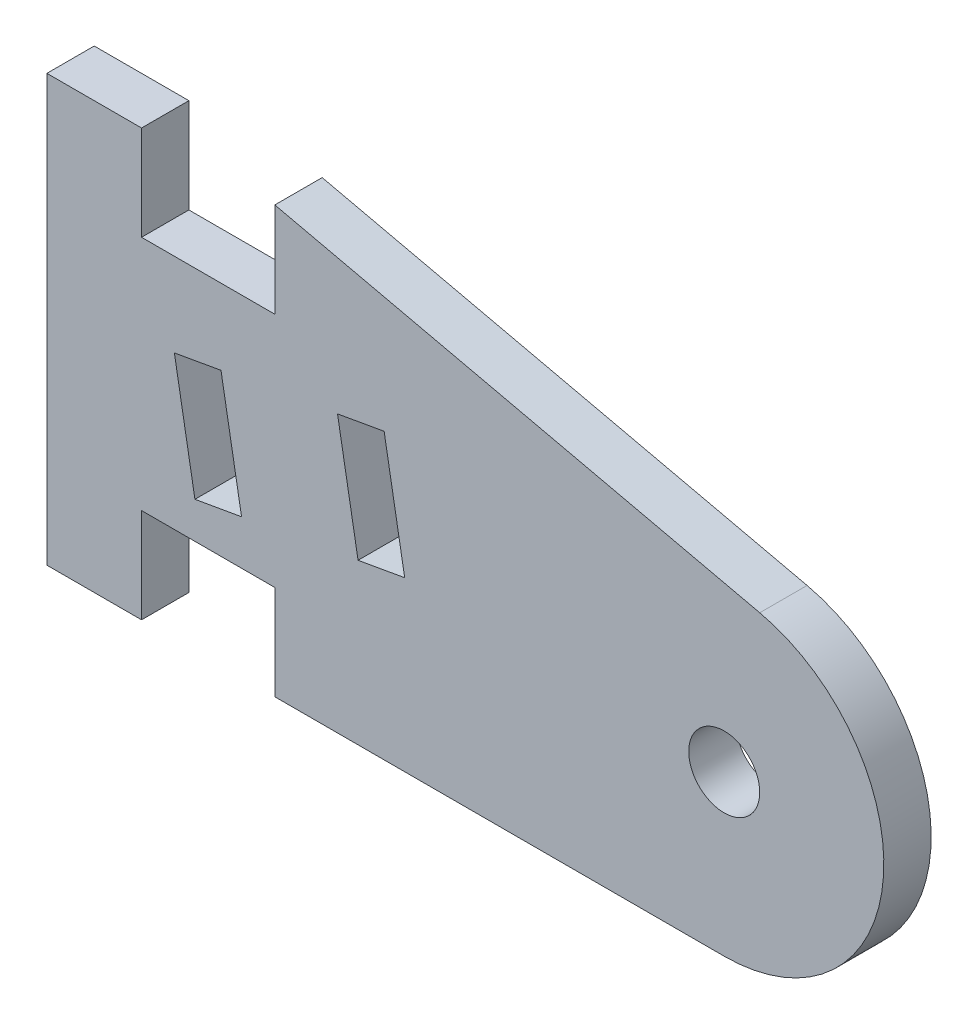
ISO-10303-21;
HEADER;
FILE_DESCRIPTION(('STEP AP214'),'2;1');
FILE_NAME('part.step','',(''),(''),'','','');
FILE_SCHEMA(('AUTOMOTIVE_DESIGN { 1 0 10303 214 1 1 1 1 }'));
ENDSEC;
DATA;
#1=APPLICATION_CONTEXT('core data for automotive mechanical design processes');
#2=APPLICATION_PROTOCOL_DEFINITION('international standard','automotive_design',2000,#1);
#3=PRODUCT_CONTEXT('',#1,'mechanical');
#4=PRODUCT('Part','Part','',(#3));
#5=PRODUCT_RELATED_PRODUCT_CATEGORY('part','',(#4));
#6=PRODUCT_DEFINITION_FORMATION('','',#4);
#7=PRODUCT_DEFINITION_CONTEXT('part definition',#1,'design');
#8=PRODUCT_DEFINITION('design','',#6,#7);
#9=PRODUCT_DEFINITION_SHAPE('','',#8);
#10=(LENGTH_UNIT() NAMED_UNIT(*) SI_UNIT(.MILLI.,.METRE.));
#11=(NAMED_UNIT(*) PLANE_ANGLE_UNIT() SI_UNIT($,.RADIAN.));
#12=(NAMED_UNIT(*) SI_UNIT($,.STERADIAN.) SOLID_ANGLE_UNIT());
#13=UNCERTAINTY_MEASURE_WITH_UNIT(LENGTH_MEASURE(1.E-05),#10,'distance_accuracy_value','');
#14=(GEOMETRIC_REPRESENTATION_CONTEXT(3) GLOBAL_UNCERTAINTY_ASSIGNED_CONTEXT((#13)) GLOBAL_UNIT_ASSIGNED_CONTEXT((#10,
#11,#12)) REPRESENTATION_CONTEXT('',''));
#15=CARTESIAN_POINT('',(0.,0.,0.));
#16=DIRECTION('',(0.,0.,1.));
#17=DIRECTION('',(1.,0.,0.));
#18=AXIS2_PLACEMENT_3D('',#15,#16,#17);
#19=CARTESIAN_POINT('',(28.6215163494173,6.74504414299814,2.));
#20=DIRECTION('',(0.,0.,1.));
#21=DIRECTION('',(1.,0.,0.));
#22=AXIS2_PLACEMENT_3D('',#19,#20,#21);
#23=PLANE('',#22);
#24=DIRECTION('',(-0.984807753012208,-0.173648177666932,0.));
#25=VECTOR('',#24,1.);
#26=CARTESIAN_POINT('',(14.2504500193325,12.02557168038,2.));
#27=LINE('',#26,#25);
#28=CARTESIAN_POINT('',(14.2504500193325,12.02557168038,2.));
#29=VERTEX_POINT('',#28);
#30=CARTESIAN_POINT('',(12.280834513308,11.6782753250461,2.));
#31=VERTEX_POINT('',#30);
#32=EDGE_CURVE('E178',#29,#31,#27,.T.);
#33=ORIENTED_EDGE('',*,*,#32,.F.);
#34=DIRECTION('',(-0.173648177666932,0.984807753012208,0.));
#35=VECTOR('',#34,1.);
#36=CARTESIAN_POINT('',(14.2504500193325,12.02557168038,2.));
#37=LINE('',#36,#35);
#38=CARTESIAN_POINT('',(15.1186909076671,7.10153291531894,2.));
#39=VERTEX_POINT('',#38);
#40=EDGE_CURVE('E170',#39,#29,#37,.T.);
#41=ORIENTED_EDGE('',*,*,#40,.F.);
#42=DIRECTION('',(0.984807753012208,0.173648177666931,0.));
#43=VECTOR('',#42,1.);
#44=CARTESIAN_POINT('',(13.1490754016427,6.75423655998508,2.));
#45=LINE('',#44,#43);
#46=CARTESIAN_POINT('',(13.1490754016427,6.75423655998508,2.));
#47=VERTEX_POINT('',#46);
#48=EDGE_CURVE('E193',#47,#39,#45,.T.);
#49=ORIENTED_EDGE('',*,*,#48,.F.);
#50=DIRECTION('',(0.173648177666932,-0.984807753012208,0.));
#51=VECTOR('',#50,1.);
#52=CARTESIAN_POINT('',(12.280834513308,11.6782753250461,2.));
#53=LINE('',#52,#51);
#54=EDGE_CURVE('E191',#31,#47,#53,.T.);
#55=ORIENTED_EDGE('',*,*,#54,.F.);
#56=EDGE_LOOP('',(#33,#41,#49,#55));
#57=FACE_BOUND('',#56,.T.);
#58=DIRECTION('',(0.,-1.,0.));
#59=VECTOR('',#58,1.);
#60=CARTESIAN_POINT('',(9.63151634941732,18.0003410835651,2.));
#61=LINE('',#60,#59);
#62=CARTESIAN_POINT('',(9.63151634941732,18.0003410835651,2.));
#63=VERTEX_POINT('',#62);
#64=CARTESIAN_POINT('',(9.63151634941733,14.0003410835651,2.));
#65=VERTEX_POINT('',#64);
#66=EDGE_CURVE('E240',#63,#65,#61,.T.);
#67=ORIENTED_EDGE('',*,*,#66,.T.);
#68=DIRECTION('',(-1.,0.,0.));
#69=VECTOR('',#68,1.);
#70=CARTESIAN_POINT('',(9.63151634941733,14.0003410835651,2.));
#71=LINE('',#70,#69);
#72=CARTESIAN_POINT('',(4.,14.0003410835651,2.));
#73=VERTEX_POINT('',#72);
#74=EDGE_CURVE('E243',#65,#73,#71,.T.);
#75=ORIENTED_EDGE('',*,*,#74,.T.);
#76=DIRECTION('',(0.,1.,0.));
#77=VECTOR('',#76,1.);
#78=CARTESIAN_POINT('',(4.,18.0003410835651,2.));
#79=LINE('',#78,#77);
#80=CARTESIAN_POINT('',(4.,18.0003410835651,2.));
#81=VERTEX_POINT('',#80);
#82=EDGE_CURVE('E246',#73,#81,#79,.T.);
#83=ORIENTED_EDGE('',*,*,#82,.T.);
#84=DIRECTION('',(-1.,0.,0.));
#85=VECTOR('',#84,1.);
#86=CARTESIAN_POINT('',(0.,18.0003410835651,2.));
#87=LINE('',#86,#85);
#88=CARTESIAN_POINT('',(0.,18.0003410835651,2.));
#89=VERTEX_POINT('',#88);
#90=EDGE_CURVE('E248',#81,#89,#87,.T.);
#91=ORIENTED_EDGE('',*,*,#90,.T.);
#92=DIRECTION('',(0.,-1.,0.));
#93=VECTOR('',#92,1.);
#94=CARTESIAN_POINT('',(0.,0.,2.));
#95=LINE('',#94,#93);
#96=CARTESIAN_POINT('',(0.,0.,2.));
#97=VERTEX_POINT('',#96);
#98=EDGE_CURVE('E250',#89,#97,#95,.T.);
#99=ORIENTED_EDGE('',*,*,#98,.T.);
#100=DIRECTION('',(1.,0.,0.));
#101=VECTOR('',#100,1.);
#102=CARTESIAN_POINT('',(0.,0.,2.));
#103=LINE('',#102,#101);
#104=CARTESIAN_POINT('',(4.,0.,2.));
#105=VERTEX_POINT('',#104);
#106=EDGE_CURVE('E252',#97,#105,#103,.T.);
#107=ORIENTED_EDGE('',*,*,#106,.T.);
#108=DIRECTION('',(0.,1.,0.));
#109=VECTOR('',#108,1.);
#110=CARTESIAN_POINT('',(4.,0.,2.));
#111=LINE('',#110,#109);
#112=CARTESIAN_POINT('',(4.,4.,2.));
#113=VERTEX_POINT('',#112);
#114=EDGE_CURVE('E254',#105,#113,#111,.T.);
#115=ORIENTED_EDGE('',*,*,#114,.T.);
#116=DIRECTION('',(1.,0.,0.));
#117=VECTOR('',#116,1.);
#118=CARTESIAN_POINT('',(9.63151634941733,4.,2.));
#119=LINE('',#118,#117);
#120=CARTESIAN_POINT('',(9.63151634941733,4.,2.));
#121=VERTEX_POINT('',#120);
#122=EDGE_CURVE('E256',#113,#121,#119,.T.);
#123=ORIENTED_EDGE('',*,*,#122,.T.);
#124=DIRECTION('',(0.,-1.,0.));
#125=VECTOR('',#124,1.);
#126=CARTESIAN_POINT('',(9.63151634941733,0.,2.));
#127=LINE('',#126,#125);
#128=CARTESIAN_POINT('',(9.63151634941733,0.,2.));
#129=VERTEX_POINT('',#128);
#130=EDGE_CURVE('E258',#121,#129,#127,.T.);
#131=ORIENTED_EDGE('',*,*,#130,.T.);
#132=DIRECTION('',(1.,0.,0.));
#133=VECTOR('',#132,1.);
#134=CARTESIAN_POINT('',(9.63151634941733,0.,2.));
#135=LINE('',#134,#133);
#136=CARTESIAN_POINT('',(28.6215163494173,0.,2.));
#137=VERTEX_POINT('',#136);
#138=EDGE_CURVE('E260',#129,#137,#135,.T.);
#139=ORIENTED_EDGE('',*,*,#138,.T.);
#140=CARTESIAN_POINT('',(28.6215163494173,6.74504414299814,2.));
#141=DIRECTION('',(0.,0.,1.));
#142=DIRECTION('',(1.,0.,0.));
#143=AXIS2_PLACEMENT_3D('',#140,#141,#142);
#144=CIRCLE('',#143,6.74504414299814);
#145=CARTESIAN_POINT('',(30.1231764912827,13.3208054912624,2.));
#146=VERTEX_POINT('',#145);
#147=EDGE_CURVE('E262',#137,#146,#144,.T.);
#148=ORIENTED_EDGE('',*,*,#147,.T.);
#149=DIRECTION('',(-0.974902640939778,0.222631625535649,0.));
#150=VECTOR('',#149,1.);
#151=CARTESIAN_POINT('',(9.63151634941732,18.0003410835651,2.));
#152=LINE('',#151,#150);
#153=EDGE_CURVE('E264',#146,#63,#152,.T.);
#154=ORIENTED_EDGE('',*,*,#153,.T.);
#155=EDGE_LOOP('',(#67,#75,#83,#91,#99,#107,#115,#123,#131,#139,#148,#154));
#156=FACE_BOUND('',#155,.T.);
#157=DIRECTION('',(0.173648177666931,-0.984807753012208,0.));
#158=VECTOR('',#157,1.);
#159=CARTESIAN_POINT('',(5.38718024222247,10.4627380813776,2.));
#160=LINE('',#159,#158);
#161=CARTESIAN_POINT('',(5.38718024222247,10.4627380813776,2.));
#162=VERTEX_POINT('',#161);
#163=CARTESIAN_POINT('',(6.25542113055713,5.53869931631654,2.));
#164=VERTEX_POINT('',#163);
#165=EDGE_CURVE('E211',#162,#164,#160,.T.);
#166=ORIENTED_EDGE('',*,*,#165,.F.);
#167=DIRECTION('',(-0.984807753012208,-0.173648177666931,0.));
#168=VECTOR('',#167,1.);
#169=CARTESIAN_POINT('',(7.35679574824689,10.8100344367115,2.));
#170=LINE('',#169,#168);
#171=CARTESIAN_POINT('',(7.35679574824689,10.8100344367115,2.));
#172=VERTEX_POINT('',#171);
#173=EDGE_CURVE('E209',#172,#162,#170,.T.);
#174=ORIENTED_EDGE('',*,*,#173,.F.);
#175=DIRECTION('',(-0.173648177666931,0.984807753012208,0.));
#176=VECTOR('',#175,1.);
#177=CARTESIAN_POINT('',(7.35679574824689,10.8100344367115,2.));
#178=LINE('',#177,#176);
#179=CARTESIAN_POINT('',(8.22503663658155,5.88599567165041,2.));
#180=VERTEX_POINT('',#179);
#181=EDGE_CURVE('E217',#180,#172,#178,.T.);
#182=ORIENTED_EDGE('',*,*,#181,.F.);
#183=DIRECTION('',(0.984807753012208,0.173648177666932,0.));
#184=VECTOR('',#183,1.);
#185=CARTESIAN_POINT('',(6.25542113055713,5.53869931631654,2.));
#186=LINE('',#185,#184);
#187=EDGE_CURVE('E214',#164,#180,#186,.T.);
#188=ORIENTED_EDGE('',*,*,#187,.F.);
#189=EDGE_LOOP('',(#166,#174,#182,#188));
#190=FACE_BOUND('',#189,.T.);
#191=CARTESIAN_POINT('',(28.6215163494173,6.74504414299814,2.));
#192=DIRECTION('',(0.,0.,1.));
#193=DIRECTION('',(1.,0.,0.));
#194=AXIS2_PLACEMENT_3D('',#191,#192,#193);
#195=CIRCLE('',#194,1.49999999999871);
#196=CARTESIAN_POINT('',(30.121516349416,6.74504414299814,2.));
#197=VERTEX_POINT('',#196);
#198=EDGE_CURVE('E199',#197,#197,#195,.T.);
#199=ORIENTED_EDGE('',*,*,#198,.F.);
#200=EDGE_LOOP('',(#199));
#201=FACE_BOUND('',#200,.T.);
#202=ADVANCED_FACE('F33',(#57,#156,#190,#201),#23,.T.);
#203=CARTESIAN_POINT('',(28.6215163494173,6.74504414299814,0.));
#204=DIRECTION('',(0.,0.,1.));
#205=DIRECTION('',(1.,0.,0.));
#206=AXIS2_PLACEMENT_3D('',#203,#204,#205);
#207=PLANE('',#206);
#208=DIRECTION('',(-0.173648177666932,0.984807753012208,0.));
#209=VECTOR('',#208,1.);
#210=CARTESIAN_POINT('',(14.2504500193325,12.02557168038,0.));
#211=LINE('',#210,#209);
#212=CARTESIAN_POINT('',(15.1186909076671,7.10153291531894,0.));
#213=VERTEX_POINT('',#212);
#214=CARTESIAN_POINT('',(14.2504500193325,12.02557168038,0.));
#215=VERTEX_POINT('',#214);
#216=EDGE_CURVE('E56',#213,#215,#211,.T.);
#217=ORIENTED_EDGE('',*,*,#216,.T.);
#218=DIRECTION('',(-0.984807753012208,-0.173648177666932,0.));
#219=VECTOR('',#218,1.);
#220=CARTESIAN_POINT('',(14.2504500193325,12.02557168038,0.));
#221=LINE('',#220,#219);
#222=CARTESIAN_POINT('',(12.280834513308,11.6782753250461,0.));
#223=VERTEX_POINT('',#222);
#224=EDGE_CURVE('E185',#215,#223,#221,.T.);
#225=ORIENTED_EDGE('',*,*,#224,.T.);
#226=DIRECTION('',(0.173648177666932,-0.984807753012208,0.));
#227=VECTOR('',#226,1.);
#228=CARTESIAN_POINT('',(12.280834513308,11.6782753250461,0.));
#229=LINE('',#228,#227);
#230=CARTESIAN_POINT('',(13.1490754016427,6.75423655998508,0.));
#231=VERTEX_POINT('',#230);
#232=EDGE_CURVE('E201',#223,#231,#229,.T.);
#233=ORIENTED_EDGE('',*,*,#232,.T.);
#234=DIRECTION('',(0.984807753012208,0.173648177666931,0.));
#235=VECTOR('',#234,1.);
#236=CARTESIAN_POINT('',(13.1490754016427,6.75423655998508,0.));
#237=LINE('',#236,#235);
#238=EDGE_CURVE('E179',#231,#213,#237,.T.);
#239=ORIENTED_EDGE('',*,*,#238,.T.);
#240=EDGE_LOOP('',(#217,#225,#233,#239));
#241=FACE_BOUND('',#240,.T.);
#242=DIRECTION('',(0.,-1.,0.));
#243=VECTOR('',#242,1.);
#244=CARTESIAN_POINT('',(9.63151634941732,18.0003410835651,0.));
#245=LINE('',#244,#243);
#246=CARTESIAN_POINT('',(9.63151634941732,18.0003410835651,0.));
#247=VERTEX_POINT('',#246);
#248=CARTESIAN_POINT('',(9.63151634941733,14.0003410835651,0.));
#249=VERTEX_POINT('',#248);
#250=EDGE_CURVE('E239',#247,#249,#245,.T.);
#251=ORIENTED_EDGE('',*,*,#250,.F.);
#252=DIRECTION('',(-0.974902640939778,0.222631625535649,0.));
#253=VECTOR('',#252,1.);
#254=CARTESIAN_POINT('',(9.63151634941732,18.0003410835651,0.));
#255=LINE('',#254,#253);
#256=CARTESIAN_POINT('',(30.1231764912827,13.3208054912624,0.));
#257=VERTEX_POINT('',#256);
#258=EDGE_CURVE('E244',#257,#247,#255,.T.);
#259=ORIENTED_EDGE('',*,*,#258,.F.);
#260=CARTESIAN_POINT('',(28.6215163494173,6.74504414299814,0.));
#261=DIRECTION('',(0.,0.,1.));
#262=DIRECTION('',(1.,0.,0.));
#263=AXIS2_PLACEMENT_3D('',#260,#261,#262);
#264=CIRCLE('',#263,6.74504414299814);
#265=CARTESIAN_POINT('',(28.6215163494173,0.,0.));
#266=VERTEX_POINT('',#265);
#267=EDGE_CURVE('E287',#266,#257,#264,.T.);
#268=ORIENTED_EDGE('',*,*,#267,.F.);
#269=DIRECTION('',(1.,0.,0.));
#270=VECTOR('',#269,1.);
#271=CARTESIAN_POINT('',(9.63151634941733,0.,0.));
#272=LINE('',#271,#270);
#273=CARTESIAN_POINT('',(9.63151634941733,0.,0.));
#274=VERTEX_POINT('',#273);
#275=EDGE_CURVE('E285',#274,#266,#272,.T.);
#276=ORIENTED_EDGE('',*,*,#275,.F.);
#277=DIRECTION('',(0.,-1.,0.));
#278=VECTOR('',#277,1.);
#279=CARTESIAN_POINT('',(9.63151634941733,0.,0.));
#280=LINE('',#279,#278);
#281=CARTESIAN_POINT('',(9.63151634941733,4.,0.));
#282=VERTEX_POINT('',#281);
#283=EDGE_CURVE('E283',#282,#274,#280,.T.);
#284=ORIENTED_EDGE('',*,*,#283,.F.);
#285=DIRECTION('',(1.,0.,0.));
#286=VECTOR('',#285,1.);
#287=CARTESIAN_POINT('',(9.63151634941733,4.,0.));
#288=LINE('',#287,#286);
#289=CARTESIAN_POINT('',(4.,4.,0.));
#290=VERTEX_POINT('',#289);
#291=EDGE_CURVE('E281',#290,#282,#288,.T.);
#292=ORIENTED_EDGE('',*,*,#291,.F.);
#293=DIRECTION('',(0.,1.,0.));
#294=VECTOR('',#293,1.);
#295=CARTESIAN_POINT('',(4.,0.,0.));
#296=LINE('',#295,#294);
#297=CARTESIAN_POINT('',(4.,0.,0.));
#298=VERTEX_POINT('',#297);
#299=EDGE_CURVE('E279',#298,#290,#296,.T.);
#300=ORIENTED_EDGE('',*,*,#299,.F.);
#301=DIRECTION('',(1.,0.,0.));
#302=VECTOR('',#301,1.);
#303=CARTESIAN_POINT('',(0.,0.,0.));
#304=LINE('',#303,#302);
#305=CARTESIAN_POINT('',(0.,0.,0.));
#306=VERTEX_POINT('',#305);
#307=EDGE_CURVE('E277',#306,#298,#304,.T.);
#308=ORIENTED_EDGE('',*,*,#307,.F.);
#309=DIRECTION('',(0.,-1.,0.));
#310=VECTOR('',#309,1.);
#311=CARTESIAN_POINT('',(0.,0.,0.));
#312=LINE('',#311,#310);
#313=CARTESIAN_POINT('',(0.,18.0003410835651,0.));
#314=VERTEX_POINT('',#313);
#315=EDGE_CURVE('E275',#314,#306,#312,.T.);
#316=ORIENTED_EDGE('',*,*,#315,.F.);
#317=DIRECTION('',(-1.,0.,0.));
#318=VECTOR('',#317,1.);
#319=CARTESIAN_POINT('',(0.,18.0003410835651,0.));
#320=LINE('',#319,#318);
#321=CARTESIAN_POINT('',(4.,18.0003410835651,0.));
#322=VERTEX_POINT('',#321);
#323=EDGE_CURVE('E273',#322,#314,#320,.T.);
#324=ORIENTED_EDGE('',*,*,#323,.F.);
#325=DIRECTION('',(0.,1.,0.));
#326=VECTOR('',#325,1.);
#327=CARTESIAN_POINT('',(4.,18.0003410835651,0.));
#328=LINE('',#327,#326);
#329=CARTESIAN_POINT('',(4.,14.0003410835651,0.));
#330=VERTEX_POINT('',#329);
#331=EDGE_CURVE('E271',#330,#322,#328,.T.);
#332=ORIENTED_EDGE('',*,*,#331,.F.);
#333=DIRECTION('',(-1.,0.,0.));
#334=VECTOR('',#333,1.);
#335=CARTESIAN_POINT('',(9.63151634941733,14.0003410835651,0.));
#336=LINE('',#335,#334);
#337=EDGE_CURVE('E269',#249,#330,#336,.T.);
#338=ORIENTED_EDGE('',*,*,#337,.F.);
#339=EDGE_LOOP('',(#251,#259,#268,#276,#284,#292,#300,#308,#316,#324,#332,#338));
#340=FACE_BOUND('',#339,.T.);
#341=DIRECTION('',(-0.984807753012208,-0.173648177666931,0.));
#342=VECTOR('',#341,1.);
#343=CARTESIAN_POINT('',(7.35679574824689,10.8100344367115,0.));
#344=LINE('',#343,#342);
#345=CARTESIAN_POINT('',(7.35679574824689,10.8100344367115,0.));
#346=VERTEX_POINT('',#345);
#347=CARTESIAN_POINT('',(5.38718024222247,10.4627380813776,0.));
#348=VERTEX_POINT('',#347);
#349=EDGE_CURVE('E186',#346,#348,#344,.T.);
#350=ORIENTED_EDGE('',*,*,#349,.T.);
#351=DIRECTION('',(0.173648177666931,-0.984807753012208,0.));
#352=VECTOR('',#351,1.);
#353=CARTESIAN_POINT('',(5.38718024222247,10.4627380813776,0.));
#354=LINE('',#353,#352);
#355=CARTESIAN_POINT('',(6.25542113055713,5.53869931631654,0.));
#356=VERTEX_POINT('',#355);
#357=EDGE_CURVE('E222',#348,#356,#354,.T.);
#358=ORIENTED_EDGE('',*,*,#357,.T.);
#359=DIRECTION('',(0.984807753012208,0.173648177666932,0.));
#360=VECTOR('',#359,1.);
#361=CARTESIAN_POINT('',(6.25542113055713,5.53869931631654,0.));
#362=LINE('',#361,#360);
#363=CARTESIAN_POINT('',(8.22503663658155,5.88599567165041,0.));
#364=VERTEX_POINT('',#363);
#365=EDGE_CURVE('E225',#356,#364,#362,.T.);
#366=ORIENTED_EDGE('',*,*,#365,.T.);
#367=DIRECTION('',(-0.173648177666931,0.984807753012208,0.));
#368=VECTOR('',#367,1.);
#369=CARTESIAN_POINT('',(7.35679574824689,10.8100344367115,0.));
#370=LINE('',#369,#368);
#371=EDGE_CURVE('E212',#364,#346,#370,.T.);
#372=ORIENTED_EDGE('',*,*,#371,.T.);
#373=EDGE_LOOP('',(#350,#358,#366,#372));
#374=FACE_BOUND('',#373,.T.);
#375=CARTESIAN_POINT('',(28.6215163494173,6.74504414299814,0.));
#376=DIRECTION('',(0.,0.,1.));
#377=DIRECTION('',(1.,0.,0.));
#378=AXIS2_PLACEMENT_3D('',#375,#376,#377);
#379=CIRCLE('',#378,1.49999999999871);
#380=CARTESIAN_POINT('',(30.121516349416,6.74504414299814,0.));
#381=VERTEX_POINT('',#380);
#382=EDGE_CURVE('E581',#381,#381,#379,.T.);
#383=ORIENTED_EDGE('',*,*,#382,.T.);
#384=EDGE_LOOP('',(#383));
#385=FACE_BOUND('',#384,.T.);
#386=ADVANCED_FACE('F329',(#241,#340,#374,#385),#207,.F.);
#387=CARTESIAN_POINT('',(9.63151634941732,18.0003410835651,2.));
#388=DIRECTION('',(1.,0.,0.));
#389=DIRECTION('',(0.,1.,0.));
#390=AXIS2_PLACEMENT_3D('',#387,#388,#389);
#391=PLANE('',#390);
#392=ORIENTED_EDGE('',*,*,#250,.T.);
#393=DIRECTION('',(0.,0.,-1.));
#394=VECTOR('',#393,1.);
#395=CARTESIAN_POINT('',(9.63151634941733,14.0003410835651,2.));
#396=LINE('',#395,#394);
#397=EDGE_CURVE('E11',#65,#249,#396,.T.);
#398=ORIENTED_EDGE('',*,*,#397,.F.);
#399=ORIENTED_EDGE('',*,*,#66,.F.);
#400=DIRECTION('',(0.,0.,-1.));
#401=VECTOR('',#400,1.);
#402=CARTESIAN_POINT('',(9.63151634941732,18.0003410835651,2.));
#403=LINE('',#402,#401);
#404=EDGE_CURVE('E266',#63,#247,#403,.T.);
#405=ORIENTED_EDGE('',*,*,#404,.T.);
#406=EDGE_LOOP('',(#392,#398,#399,#405));
#407=FACE_BOUND('',#406,.T.);
#408=ADVANCED_FACE('F35',(#407),#391,.F.);
#409=CARTESIAN_POINT('',(9.63151634941733,14.0003410835651,2.));
#410=DIRECTION('',(0.,-1.,0.));
#411=DIRECTION('',(1.,0.,0.));
#412=AXIS2_PLACEMENT_3D('',#409,#410,#411);
#413=PLANE('',#412);
#414=ORIENTED_EDGE('',*,*,#337,.T.);
#415=DIRECTION('',(0.,0.,-1.));
#416=VECTOR('',#415,1.);
#417=CARTESIAN_POINT('',(4.,14.0003410835651,2.));
#418=LINE('',#417,#416);
#419=EDGE_CURVE('E41',#73,#330,#418,.T.);
#420=ORIENTED_EDGE('',*,*,#419,.F.);
#421=ORIENTED_EDGE('',*,*,#74,.F.);
#422=ORIENTED_EDGE('',*,*,#397,.T.);
#423=EDGE_LOOP('',(#414,#420,#421,#422));
#424=FACE_BOUND('',#423,.T.);
#425=ADVANCED_FACE('F346',(#424),#413,.F.);
#426=CARTESIAN_POINT('',(4.,18.0003410835651,2.));
#427=DIRECTION('',(-1.,0.,0.));
#428=DIRECTION('',(0.,-1.,0.));
#429=AXIS2_PLACEMENT_3D('',#426,#427,#428);
#430=PLANE('',#429);
#431=ORIENTED_EDGE('',*,*,#331,.T.);
#432=DIRECTION('',(0.,0.,-1.));
#433=VECTOR('',#432,1.);
#434=CARTESIAN_POINT('',(4.,18.0003410835651,2.));
#435=LINE('',#434,#433);
#436=EDGE_CURVE('E316',#81,#322,#435,.T.);
#437=ORIENTED_EDGE('',*,*,#436,.F.);
#438=ORIENTED_EDGE('',*,*,#82,.F.);
#439=ORIENTED_EDGE('',*,*,#419,.T.);
#440=EDGE_LOOP('',(#431,#437,#438,#439));
#441=FACE_BOUND('',#440,.T.);
#442=ADVANCED_FACE('F323',(#441),#430,.F.);
#443=CARTESIAN_POINT('',(0.,18.0003410835651,2.));
#444=DIRECTION('',(0.,-1.,0.));
#445=DIRECTION('',(0.,0.,-1.));
#446=AXIS2_PLACEMENT_3D('',#443,#444,#445);
#447=PLANE('',#446);
#448=ORIENTED_EDGE('',*,*,#323,.T.);
#449=DIRECTION('',(0.,0.,-1.));
#450=VECTOR('',#449,1.);
#451=CARTESIAN_POINT('',(0.,18.0003410835651,2.));
#452=LINE('',#451,#450);
#453=EDGE_CURVE('E313',#89,#314,#452,.T.);
#454=ORIENTED_EDGE('',*,*,#453,.F.);
#455=ORIENTED_EDGE('',*,*,#90,.F.);
#456=ORIENTED_EDGE('',*,*,#436,.T.);
#457=EDGE_LOOP('',(#448,#454,#455,#456));
#458=FACE_BOUND('',#457,.T.);
#459=ADVANCED_FACE('F335',(#458),#447,.F.);
#460=CARTESIAN_POINT('',(0.,0.,2.));
#461=DIRECTION('',(1.,0.,0.));
#462=DIRECTION('',(0.,1.,0.));
#463=AXIS2_PLACEMENT_3D('',#460,#461,#462);
#464=PLANE('',#463);
#465=ORIENTED_EDGE('',*,*,#315,.T.);
#466=DIRECTION('',(0.,0.,-1.));
#467=VECTOR('',#466,1.);
#468=CARTESIAN_POINT('',(0.,0.,2.));
#469=LINE('',#468,#467);
#470=EDGE_CURVE('E310',#97,#306,#469,.T.);
#471=ORIENTED_EDGE('',*,*,#470,.F.);
#472=ORIENTED_EDGE('',*,*,#98,.F.);
#473=ORIENTED_EDGE('',*,*,#453,.T.);
#474=EDGE_LOOP('',(#465,#471,#472,#473));
#475=FACE_BOUND('',#474,.T.);
#476=ADVANCED_FACE('F339',(#475),#464,.F.);
#477=CARTESIAN_POINT('',(0.,0.,2.));
#478=DIRECTION('',(0.,1.,0.));
#479=DIRECTION('',(0.,0.,1.));
#480=AXIS2_PLACEMENT_3D('',#477,#478,#479);
#481=PLANE('',#480);
#482=ORIENTED_EDGE('',*,*,#307,.T.);
#483=DIRECTION('',(0.,0.,-1.));
#484=VECTOR('',#483,1.);
#485=CARTESIAN_POINT('',(4.,0.,2.));
#486=LINE('',#485,#484);
#487=EDGE_CURVE('E307',#105,#298,#486,.T.);
#488=ORIENTED_EDGE('',*,*,#487,.F.);
#489=ORIENTED_EDGE('',*,*,#106,.F.);
#490=ORIENTED_EDGE('',*,*,#470,.T.);
#491=EDGE_LOOP('',(#482,#488,#489,#490));
#492=FACE_BOUND('',#491,.T.);
#493=ADVANCED_FACE('F379',(#492),#481,.F.);
#494=CARTESIAN_POINT('',(4.,0.,2.));
#495=DIRECTION('',(-1.,0.,0.));
#496=DIRECTION('',(0.,0.,1.));
#497=AXIS2_PLACEMENT_3D('',#494,#495,#496);
#498=PLANE('',#497);
#499=ORIENTED_EDGE('',*,*,#299,.T.);
#500=DIRECTION('',(0.,0.,-1.));
#501=VECTOR('',#500,1.);
#502=CARTESIAN_POINT('',(4.,4.,2.));
#503=LINE('',#502,#501);
#504=EDGE_CURVE('E304',#113,#290,#503,.T.);
#505=ORIENTED_EDGE('',*,*,#504,.F.);
#506=ORIENTED_EDGE('',*,*,#114,.F.);
#507=ORIENTED_EDGE('',*,*,#487,.T.);
#508=EDGE_LOOP('',(#499,#505,#506,#507));
#509=FACE_BOUND('',#508,.T.);
#510=ADVANCED_FACE('F377',(#509),#498,.F.);
#511=CARTESIAN_POINT('',(9.63151634941733,4.,2.));
#512=DIRECTION('',(0.,1.,0.));
#513=DIRECTION('',(-1.,0.,0.));
#514=AXIS2_PLACEMENT_3D('',#511,#512,#513);
#515=PLANE('',#514);
#516=ORIENTED_EDGE('',*,*,#291,.T.);
#517=DIRECTION('',(0.,0.,-1.));
#518=VECTOR('',#517,1.);
#519=CARTESIAN_POINT('',(9.63151634941733,4.,2.));
#520=LINE('',#519,#518);
#521=EDGE_CURVE('E301',#121,#282,#520,.T.);
#522=ORIENTED_EDGE('',*,*,#521,.F.);
#523=ORIENTED_EDGE('',*,*,#122,.F.);
#524=ORIENTED_EDGE('',*,*,#504,.T.);
#525=EDGE_LOOP('',(#516,#522,#523,#524));
#526=FACE_BOUND('',#525,.T.);
#527=ADVANCED_FACE('F373',(#526),#515,.F.);
#528=CARTESIAN_POINT('',(9.63151634941733,0.,2.));
#529=DIRECTION('',(1.,0.,0.));
#530=DIRECTION('',(0.,0.,-1.));
#531=AXIS2_PLACEMENT_3D('',#528,#529,#530);
#532=PLANE('',#531);
#533=ORIENTED_EDGE('',*,*,#283,.T.);
#534=DIRECTION('',(0.,0.,-1.));
#535=VECTOR('',#534,1.);
#536=CARTESIAN_POINT('',(9.63151634941733,0.,2.));
#537=LINE('',#536,#535);
#538=EDGE_CURVE('E298',#129,#274,#537,.T.);
#539=ORIENTED_EDGE('',*,*,#538,.F.);
#540=ORIENTED_EDGE('',*,*,#130,.F.);
#541=ORIENTED_EDGE('',*,*,#521,.T.);
#542=EDGE_LOOP('',(#533,#539,#540,#541));
#543=FACE_BOUND('',#542,.T.);
#544=ADVANCED_FACE('F368',(#543),#532,.F.);
#545=CARTESIAN_POINT('',(9.63151634941733,0.,2.));
#546=DIRECTION('',(0.,1.,0.));
#547=DIRECTION('',(0.,0.,1.));
#548=AXIS2_PLACEMENT_3D('',#545,#546,#547);
#549=PLANE('',#548);
#550=ORIENTED_EDGE('',*,*,#275,.T.);
#551=DIRECTION('',(0.,0.,-1.));
#552=VECTOR('',#551,1.);
#553=CARTESIAN_POINT('',(28.6215163494173,0.,2.));
#554=LINE('',#553,#552);
#555=EDGE_CURVE('E295',#137,#266,#554,.T.);
#556=ORIENTED_EDGE('',*,*,#555,.F.);
#557=ORIENTED_EDGE('',*,*,#138,.F.);
#558=ORIENTED_EDGE('',*,*,#538,.T.);
#559=EDGE_LOOP('',(#550,#556,#557,#558));
#560=FACE_BOUND('',#559,.T.);
#561=ADVANCED_FACE('F362',(#560),#549,.F.);
#562=CARTESIAN_POINT('',(28.6215163494173,6.74504414299814,2.));
#563=DIRECTION('',(0.,0.,-1.));
#564=DIRECTION('',(-1.,0.,0.));
#565=AXIS2_PLACEMENT_3D('',#562,#563,#564);
#566=CYLINDRICAL_SURFACE('',#565,6.74504414299814);
#567=ORIENTED_EDGE('',*,*,#267,.T.);
#568=DIRECTION('',(0.,0.,-1.));
#569=VECTOR('',#568,1.);
#570=CARTESIAN_POINT('',(30.1231764912827,13.3208054912624,2.));
#571=LINE('',#570,#569);
#572=EDGE_CURVE('E292',#146,#257,#571,.T.);
#573=ORIENTED_EDGE('',*,*,#572,.F.);
#574=ORIENTED_EDGE('',*,*,#147,.F.);
#575=ORIENTED_EDGE('',*,*,#555,.T.);
#576=EDGE_LOOP('',(#567,#573,#574,#575));
#577=FACE_BOUND('',#576,.T.);
#578=ADVANCED_FACE('F358',(#577),#566,.T.);
#579=CARTESIAN_POINT('',(9.63151634941732,18.0003410835651,2.));
#580=DIRECTION('',(-0.222631625535649,-0.974902640939778,0.));
#581=DIRECTION('',(0.974902640939778,-0.222631625535649,0.));
#582=AXIS2_PLACEMENT_3D('',#579,#580,#581);
#583=PLANE('',#582);
#584=ORIENTED_EDGE('',*,*,#258,.T.);
#585=ORIENTED_EDGE('',*,*,#404,.F.);
#586=ORIENTED_EDGE('',*,*,#153,.F.);
#587=ORIENTED_EDGE('',*,*,#572,.T.);
#588=EDGE_LOOP('',(#584,#585,#586,#587));
#589=FACE_BOUND('',#588,.T.);
#590=ADVANCED_FACE('F353',(#589),#583,.F.);
#591=CARTESIAN_POINT('',(7.35679574824689,10.8100344367115,2.));
#592=DIRECTION('',(0.173648177666931,-0.984807753012208,0.));
#593=DIRECTION('',(0.984807753012208,0.173648177666931,0.));
#594=AXIS2_PLACEMENT_3D('',#591,#592,#593);
#595=PLANE('',#594);
#596=ORIENTED_EDGE('',*,*,#349,.F.);
#597=DIRECTION('',(0.,0.,-1.));
#598=VECTOR('',#597,1.);
#599=CARTESIAN_POINT('',(7.35679574824689,10.8100344367115,2.));
#600=LINE('',#599,#598);
#601=EDGE_CURVE('E219',#172,#346,#600,.T.);
#602=ORIENTED_EDGE('',*,*,#601,.F.);
#603=ORIENTED_EDGE('',*,*,#173,.T.);
#604=DIRECTION('',(0.,0.,-1.));
#605=VECTOR('',#604,1.);
#606=CARTESIAN_POINT('',(5.38718024222247,10.4627380813776,2.));
#607=LINE('',#606,#605);
#608=EDGE_CURVE('E236',#162,#348,#607,.T.);
#609=ORIENTED_EDGE('',*,*,#608,.T.);
#610=EDGE_LOOP('',(#596,#602,#603,#609));
#611=FACE_BOUND('',#610,.T.);
#612=ADVANCED_FACE('F396',(#611),#595,.T.);
#613=CARTESIAN_POINT('',(5.38718024222247,10.4627380813776,2.));
#614=DIRECTION('',(0.984807753012208,0.173648177666931,0.));
#615=DIRECTION('',(-0.173648177666931,0.984807753012208,0.));
#616=AXIS2_PLACEMENT_3D('',#613,#614,#615);
#617=PLANE('',#616);
#618=ORIENTED_EDGE('',*,*,#357,.F.);
#619=ORIENTED_EDGE('',*,*,#608,.F.);
#620=ORIENTED_EDGE('',*,*,#165,.T.);
#621=DIRECTION('',(0.,0.,-1.));
#622=VECTOR('',#621,1.);
#623=CARTESIAN_POINT('',(6.25542113055713,5.53869931631654,2.));
#624=LINE('',#623,#622);
#625=EDGE_CURVE('E234',#164,#356,#624,.T.);
#626=ORIENTED_EDGE('',*,*,#625,.T.);
#627=EDGE_LOOP('',(#618,#619,#620,#626));
#628=FACE_BOUND('',#627,.T.);
#629=ADVANCED_FACE('F434',(#628),#617,.T.);
#630=CARTESIAN_POINT('',(6.25542113055713,5.53869931631654,2.));
#631=DIRECTION('',(-0.173648177666932,0.984807753012208,0.));
#632=DIRECTION('',(-0.984807753012208,-0.173648177666932,0.));
#633=AXIS2_PLACEMENT_3D('',#630,#631,#632);
#634=PLANE('',#633);
#635=ORIENTED_EDGE('',*,*,#365,.F.);
#636=ORIENTED_EDGE('',*,*,#625,.F.);
#637=ORIENTED_EDGE('',*,*,#187,.T.);
#638=DIRECTION('',(0.,0.,-1.));
#639=VECTOR('',#638,1.);
#640=CARTESIAN_POINT('',(8.22503663658155,5.88599567165041,2.));
#641=LINE('',#640,#639);
#642=EDGE_CURVE('E232',#180,#364,#641,.T.);
#643=ORIENTED_EDGE('',*,*,#642,.T.);
#644=EDGE_LOOP('',(#635,#636,#637,#643));
#645=FACE_BOUND('',#644,.T.);
#646=ADVANCED_FACE('F441',(#645),#634,.T.);
#647=CARTESIAN_POINT('',(7.35679574824689,10.8100344367115,2.));
#648=DIRECTION('',(-0.984807753012208,-0.173648177666931,0.));
#649=DIRECTION('',(0.173648177666931,-0.984807753012208,0.));
#650=AXIS2_PLACEMENT_3D('',#647,#648,#649);
#651=PLANE('',#650);
#652=ORIENTED_EDGE('',*,*,#371,.F.);
#653=ORIENTED_EDGE('',*,*,#642,.F.);
#654=ORIENTED_EDGE('',*,*,#181,.T.);
#655=ORIENTED_EDGE('',*,*,#601,.T.);
#656=EDGE_LOOP('',(#652,#653,#654,#655));
#657=FACE_BOUND('',#656,.T.);
#658=ADVANCED_FACE('F448',(#657),#651,.T.);
#659=CARTESIAN_POINT('',(14.2504500193325,12.02557168038,2.));
#660=DIRECTION('',(-0.984807753012208,-0.173648177666932,0.));
#661=DIRECTION('',(0.173648177666932,-0.984807753012208,0.));
#662=AXIS2_PLACEMENT_3D('',#659,#660,#661);
#663=PLANE('',#662);
#664=ORIENTED_EDGE('',*,*,#216,.F.);
#665=DIRECTION('',(0.,0.,-1.));
#666=VECTOR('',#665,1.);
#667=CARTESIAN_POINT('',(15.1186909076671,7.10153291531894,2.));
#668=LINE('',#667,#666);
#669=EDGE_CURVE('E174',#39,#213,#668,.T.);
#670=ORIENTED_EDGE('',*,*,#669,.F.);
#671=ORIENTED_EDGE('',*,*,#40,.T.);
#672=DIRECTION('',(0.,0.,-1.));
#673=VECTOR('',#672,1.);
#674=CARTESIAN_POINT('',(14.2504500193325,12.02557168038,2.));
#675=LINE('',#674,#673);
#676=EDGE_CURVE('E173',#29,#215,#675,.T.);
#677=ORIENTED_EDGE('',*,*,#676,.T.);
#678=EDGE_LOOP('',(#664,#670,#671,#677));
#679=FACE_BOUND('',#678,.T.);
#680=ADVANCED_FACE('F172',(#679),#663,.T.);
#681=CARTESIAN_POINT('',(14.2504500193325,12.02557168038,2.));
#682=DIRECTION('',(0.173648177666932,-0.984807753012208,0.));
#683=DIRECTION('',(0.984807753012208,0.173648177666932,0.));
#684=AXIS2_PLACEMENT_3D('',#681,#682,#683);
#685=PLANE('',#684);
#686=ORIENTED_EDGE('',*,*,#224,.F.);
#687=ORIENTED_EDGE('',*,*,#676,.F.);
#688=ORIENTED_EDGE('',*,*,#32,.T.);
#689=DIRECTION('',(0.,0.,-1.));
#690=VECTOR('',#689,1.);
#691=CARTESIAN_POINT('',(12.280834513308,11.6782753250461,2.));
#692=LINE('',#691,#690);
#693=EDGE_CURVE('E187',#31,#223,#692,.T.);
#694=ORIENTED_EDGE('',*,*,#693,.T.);
#695=EDGE_LOOP('',(#686,#687,#688,#694));
#696=FACE_BOUND('',#695,.T.);
#697=ADVANCED_FACE('F182',(#696),#685,.T.);
#698=CARTESIAN_POINT('',(12.280834513308,11.6782753250461,2.));
#699=DIRECTION('',(0.984807753012208,0.173648177666932,0.));
#700=DIRECTION('',(-0.173648177666932,0.984807753012208,0.));
#701=AXIS2_PLACEMENT_3D('',#698,#699,#700);
#702=PLANE('',#701);
#703=ORIENTED_EDGE('',*,*,#232,.F.);
#704=ORIENTED_EDGE('',*,*,#693,.F.);
#705=ORIENTED_EDGE('',*,*,#54,.T.);
#706=DIRECTION('',(0.,0.,-1.));
#707=VECTOR('',#706,1.);
#708=CARTESIAN_POINT('',(13.1490754016427,6.75423655998508,2.));
#709=LINE('',#708,#707);
#710=EDGE_CURVE('E48',#47,#231,#709,.T.);
#711=ORIENTED_EDGE('',*,*,#710,.T.);
#712=EDGE_LOOP('',(#703,#704,#705,#711));
#713=FACE_BOUND('',#712,.T.);
#714=ADVANCED_FACE('F469',(#713),#702,.T.);
#715=CARTESIAN_POINT('',(13.1490754016427,6.75423655998508,2.));
#716=DIRECTION('',(-0.173648177666931,0.984807753012208,0.));
#717=DIRECTION('',(-0.984807753012208,-0.173648177666931,0.));
#718=AXIS2_PLACEMENT_3D('',#715,#716,#717);
#719=PLANE('',#718);
#720=ORIENTED_EDGE('',*,*,#238,.F.);
#721=ORIENTED_EDGE('',*,*,#710,.F.);
#722=ORIENTED_EDGE('',*,*,#48,.T.);
#723=ORIENTED_EDGE('',*,*,#669,.T.);
#724=EDGE_LOOP('',(#720,#721,#722,#723));
#725=FACE_BOUND('',#724,.T.);
#726=ADVANCED_FACE('F476',(#725),#719,.T.);
#727=CARTESIAN_POINT('',(28.6215163494173,6.74504414299814,2.));
#728=DIRECTION('',(0.,0.,-1.));
#729=DIRECTION('',(-1.,0.,0.));
#730=AXIS2_PLACEMENT_3D('',#727,#728,#729);
#731=CYLINDRICAL_SURFACE('',#730,1.49999999999871);
#732=ORIENTED_EDGE('',*,*,#198,.T.);
#733=EDGE_LOOP('',(#732));
#734=FACE_BOUND('',#733,.T.);
#735=ORIENTED_EDGE('',*,*,#382,.F.);
#736=EDGE_LOOP('',(#735));
#737=FACE_BOUND('',#736,.T.);
#738=ADVANCED_FACE('F484',(#734,#737),#731,.F.);
#739=CLOSED_SHELL('',(#202,#386,#408,#425,#442,#459,#476,#493,#510,#527,#544,#561,#578,#590,
#612,#629,#646,#658,#680,#697,#714,#726,#738));
#740=MANIFOLD_SOLID_BREP('B2',#739);
#741=ADVANCED_BREP_SHAPE_REPRESENTATION('',(#18,#740),#14);
#742=SHAPE_DEFINITION_REPRESENTATION(#9,#741);
ENDSEC;
END-ISO-10303-21;
